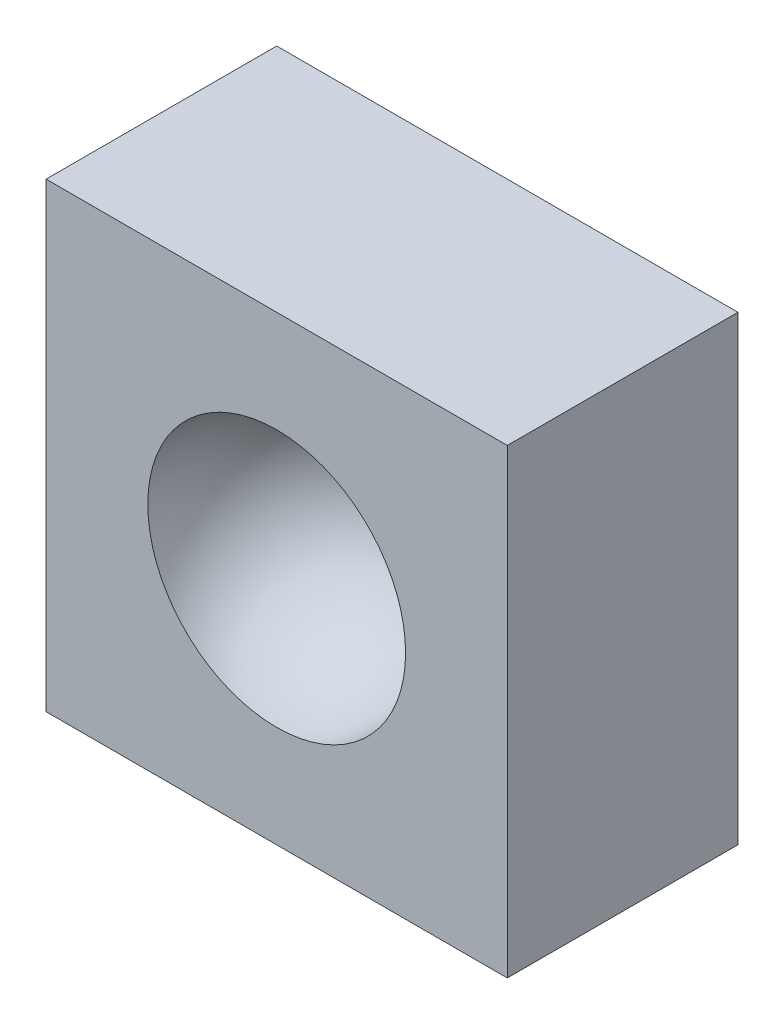
ISO-10303-21;
HEADER;
FILE_DESCRIPTION(('STEP AP214'),'2;1');
FILE_NAME('part.step','',(''),(''),'','','');
FILE_SCHEMA(('AUTOMOTIVE_DESIGN { 1 0 10303 214 1 1 1 1 }'));
ENDSEC;
DATA;
#1=APPLICATION_CONTEXT('core data for automotive mechanical design processes');
#2=APPLICATION_PROTOCOL_DEFINITION('international standard','automotive_design',2000,#1);
#3=PRODUCT_CONTEXT('',#1,'mechanical');
#4=PRODUCT('Part','Part','',(#3));
#5=PRODUCT_RELATED_PRODUCT_CATEGORY('part','',(#4));
#6=PRODUCT_DEFINITION_FORMATION('','',#4);
#7=PRODUCT_DEFINITION_CONTEXT('part definition',#1,'design');
#8=PRODUCT_DEFINITION('design','',#6,#7);
#9=PRODUCT_DEFINITION_SHAPE('','',#8);
#10=(LENGTH_UNIT() NAMED_UNIT(*) SI_UNIT(.MILLI.,.METRE.));
#11=(NAMED_UNIT(*) PLANE_ANGLE_UNIT() SI_UNIT($,.RADIAN.));
#12=(NAMED_UNIT(*) SI_UNIT($,.STERADIAN.) SOLID_ANGLE_UNIT());
#13=UNCERTAINTY_MEASURE_WITH_UNIT(LENGTH_MEASURE(1.E-05),#10,'distance_accuracy_value','');
#14=(GEOMETRIC_REPRESENTATION_CONTEXT(3) GLOBAL_UNCERTAINTY_ASSIGNED_CONTEXT((#13)) GLOBAL_UNIT_ASSIGNED_CONTEXT((#10,
#11,#12)) REPRESENTATION_CONTEXT('',''));
#15=CARTESIAN_POINT('',(0.,0.,0.));
#16=DIRECTION('',(0.,0.,1.));
#17=DIRECTION('',(1.,0.,0.));
#18=AXIS2_PLACEMENT_3D('',#15,#16,#17);
#19=CARTESIAN_POINT('',(50.,-50.,50.));
#20=DIRECTION('',(0.,0.,1.));
#21=DIRECTION('',(1.,0.,0.));
#22=AXIS2_PLACEMENT_3D('',#19,#20,#21);
#23=PLANE('',#22);
#24=DIRECTION('',(0.,1.,0.));
#25=VECTOR('',#24,1.);
#26=CARTESIAN_POINT('',(50.,50.,50.));
#27=LINE('',#26,#25);
#28=CARTESIAN_POINT('',(50.,-50.,50.));
#29=VERTEX_POINT('',#28);
#30=CARTESIAN_POINT('',(50.,50.,50.));
#31=VERTEX_POINT('',#30);
#32=EDGE_CURVE('E84',#29,#31,#27,.T.);
#33=ORIENTED_EDGE('',*,*,#32,.T.);
#34=DIRECTION('',(-1.,0.,0.));
#35=VECTOR('',#34,1.);
#36=CARTESIAN_POINT('',(-50.,50.,50.));
#37=LINE('',#36,#35);
#38=CARTESIAN_POINT('',(-50.,50.,50.));
#39=VERTEX_POINT('',#38);
#40=EDGE_CURVE('E79',#31,#39,#37,.T.);
#41=ORIENTED_EDGE('',*,*,#40,.T.);
#42=DIRECTION('',(0.,-1.,0.));
#43=VECTOR('',#42,1.);
#44=CARTESIAN_POINT('',(-50.,50.,50.));
#45=LINE('',#44,#43);
#46=CARTESIAN_POINT('',(-50.,-50.,50.));
#47=VERTEX_POINT('',#46);
#48=EDGE_CURVE('E82',#39,#47,#45,.T.);
#49=ORIENTED_EDGE('',*,*,#48,.T.);
#50=DIRECTION('',(1.,0.,0.));
#51=VECTOR('',#50,1.);
#52=CARTESIAN_POINT('',(-50.,-50.,50.));
#53=LINE('',#52,#51);
#54=EDGE_CURVE('E49',#47,#29,#53,.T.);
#55=ORIENTED_EDGE('',*,*,#54,.T.);
#56=EDGE_LOOP('',(#33,#41,#49,#55));
#57=FACE_BOUND('',#56,.T.);
#58=CARTESIAN_POINT('',(0.,0.,50.));
#59=DIRECTION('',(0.,0.,1.));
#60=DIRECTION('',(1.,0.,0.));
#61=AXIS2_PLACEMENT_3D('',#58,#59,#60);
#62=CIRCLE('',#61,27.9453563464902);
#63=CARTESIAN_POINT('',(27.9453563464902,0.,50.));
#64=VERTEX_POINT('',#63);
#65=EDGE_CURVE('E35',#64,#64,#62,.F.);
#66=ORIENTED_EDGE('',*,*,#65,.T.);
#67=EDGE_LOOP('',(#66));
#68=FACE_BOUND('',#67,.T.);
#69=ADVANCED_FACE('F31',(#57,#68),#23,.T.);
#70=CARTESIAN_POINT('',(50.,50.,50.));
#71=DIRECTION('',(-1.,0.,0.));
#72=DIRECTION('',(0.,-1.,0.));
#73=AXIS2_PLACEMENT_3D('',#70,#71,#72);
#74=PLANE('',#73);
#75=DIRECTION('',(0.,1.,0.));
#76=VECTOR('',#75,1.);
#77=CARTESIAN_POINT('',(50.,50.,0.));
#78=LINE('',#77,#76);
#79=CARTESIAN_POINT('',(50.,-50.,0.));
#80=VERTEX_POINT('',#79);
#81=CARTESIAN_POINT('',(50.,50.,0.));
#82=VERTEX_POINT('',#81);
#83=EDGE_CURVE('E97',#80,#82,#78,.T.);
#84=ORIENTED_EDGE('',*,*,#83,.T.);
#85=DIRECTION('',(0.,0.,-1.));
#86=VECTOR('',#85,1.);
#87=CARTESIAN_POINT('',(50.,50.,50.));
#88=LINE('',#87,#86);
#89=EDGE_CURVE('E11',#31,#82,#88,.T.);
#90=ORIENTED_EDGE('',*,*,#89,.F.);
#91=ORIENTED_EDGE('',*,*,#32,.F.);
#92=DIRECTION('',(0.,0.,-1.));
#93=VECTOR('',#92,1.);
#94=CARTESIAN_POINT('',(50.,-50.,50.));
#95=LINE('',#94,#93);
#96=EDGE_CURVE('E93',#29,#80,#95,.T.);
#97=ORIENTED_EDGE('',*,*,#96,.T.);
#98=EDGE_LOOP('',(#84,#90,#91,#97));
#99=FACE_BOUND('',#98,.T.);
#100=ADVANCED_FACE('F33',(#99),#74,.F.);
#101=CARTESIAN_POINT('',(-50.,50.,50.));
#102=DIRECTION('',(0.,-1.,0.));
#103=DIRECTION('',(0.,0.,-1.));
#104=AXIS2_PLACEMENT_3D('',#101,#102,#103);
#105=PLANE('',#104);
#106=DIRECTION('',(-1.,0.,0.));
#107=VECTOR('',#106,1.);
#108=CARTESIAN_POINT('',(-50.,50.,0.));
#109=LINE('',#108,#107);
#110=CARTESIAN_POINT('',(-50.,50.,0.));
#111=VERTEX_POINT('',#110);
#112=EDGE_CURVE('E88',#82,#111,#109,.T.);
#113=ORIENTED_EDGE('',*,*,#112,.T.);
#114=DIRECTION('',(0.,0.,-1.));
#115=VECTOR('',#114,1.);
#116=CARTESIAN_POINT('',(-50.,50.,50.));
#117=LINE('',#116,#115);
#118=EDGE_CURVE('E41',#39,#111,#117,.T.);
#119=ORIENTED_EDGE('',*,*,#118,.F.);
#120=ORIENTED_EDGE('',*,*,#40,.F.);
#121=ORIENTED_EDGE('',*,*,#89,.T.);
#122=EDGE_LOOP('',(#113,#119,#120,#121));
#123=FACE_BOUND('',#122,.T.);
#124=ADVANCED_FACE('F87',(#123),#105,.F.);
#125=CARTESIAN_POINT('',(-50.,50.,50.));
#126=DIRECTION('',(1.,0.,0.));
#127=DIRECTION('',(0.,1.,0.));
#128=AXIS2_PLACEMENT_3D('',#125,#126,#127);
#129=PLANE('',#128);
#130=DIRECTION('',(0.,-1.,0.));
#131=VECTOR('',#130,1.);
#132=CARTESIAN_POINT('',(-50.,50.,0.));
#133=LINE('',#132,#131);
#134=CARTESIAN_POINT('',(-50.,-50.,0.));
#135=VERTEX_POINT('',#134);
#136=EDGE_CURVE('E66',#111,#135,#133,.T.);
#137=ORIENTED_EDGE('',*,*,#136,.T.);
#138=DIRECTION('',(0.,0.,-1.));
#139=VECTOR('',#138,1.);
#140=CARTESIAN_POINT('',(-50.,-50.,50.));
#141=LINE('',#140,#139);
#142=EDGE_CURVE('E89',#47,#135,#141,.T.);
#143=ORIENTED_EDGE('',*,*,#142,.F.);
#144=ORIENTED_EDGE('',*,*,#48,.F.);
#145=ORIENTED_EDGE('',*,*,#118,.T.);
#146=EDGE_LOOP('',(#137,#143,#144,#145));
#147=FACE_BOUND('',#146,.T.);
#148=ADVANCED_FACE('F91',(#147),#129,.F.);
#149=CARTESIAN_POINT('',(-50.,-50.,50.));
#150=DIRECTION('',(0.,1.,0.));
#151=DIRECTION('',(0.,0.,1.));
#152=AXIS2_PLACEMENT_3D('',#149,#150,#151);
#153=PLANE('',#152);
#154=DIRECTION('',(1.,0.,0.));
#155=VECTOR('',#154,1.);
#156=CARTESIAN_POINT('',(-50.,-50.,0.));
#157=LINE('',#156,#155);
#158=EDGE_CURVE('E72',#135,#80,#157,.T.);
#159=ORIENTED_EDGE('',*,*,#158,.T.);
#160=ORIENTED_EDGE('',*,*,#96,.F.);
#161=ORIENTED_EDGE('',*,*,#54,.F.);
#162=ORIENTED_EDGE('',*,*,#142,.T.);
#163=EDGE_LOOP('',(#159,#160,#161,#162));
#164=FACE_BOUND('',#163,.T.);
#165=ADVANCED_FACE('F104',(#164),#153,.F.);
#166=CARTESIAN_POINT('',(50.,-50.,0.));
#167=DIRECTION('',(0.,0.,1.));
#168=DIRECTION('',(1.,0.,0.));
#169=AXIS2_PLACEMENT_3D('',#166,#167,#168);
#170=PLANE('',#169);
#171=ORIENTED_EDGE('',*,*,#83,.F.);
#172=ORIENTED_EDGE('',*,*,#158,.F.);
#173=ORIENTED_EDGE('',*,*,#136,.F.);
#174=ORIENTED_EDGE('',*,*,#112,.F.);
#175=EDGE_LOOP('',(#171,#172,#173,#174));
#176=FACE_BOUND('',#175,.T.);
#177=ADVANCED_FACE('F107',(#176),#170,.F.);
#178=CARTESIAN_POINT('',(0.,0.,50.));
#179=DIRECTION('',(-1.,0.,0.));
#180=DIRECTION('',(0.,1.,0.));
#181=AXIS2_PLACEMENT_3D('',#178,#179,#180);
#182=SPHERICAL_SURFACE('',#181,27.9453563464902);
#183=CARTESIAN_POINT('',(0.,0.,50.));
#184=DIRECTION('',(0.,0.,1.));
#185=DIRECTION('',(1.,0.,0.));
#186=AXIS2_PLACEMENT_3D('',#183,#184,#185);
#187=SPHERICAL_SURFACE('',#186,27.9453563464902);
#188=ORIENTED_EDGE('',*,*,#65,.F.);
#189=EDGE_LOOP('',(#188));
#190=FACE_BOUND('',#189,.T.);
#191=ADVANCED_FACE('F119',(#190),#187,.F.);
#192=CLOSED_SHELL('',(#69,#100,#124,#148,#165,#177,#191));
#193=MANIFOLD_SOLID_BREP('B2',#192);
#194=ADVANCED_BREP_SHAPE_REPRESENTATION('',(#18,#193),#14);
#195=SHAPE_DEFINITION_REPRESENTATION(#9,#194);
ENDSEC;
END-ISO-10303-21;
